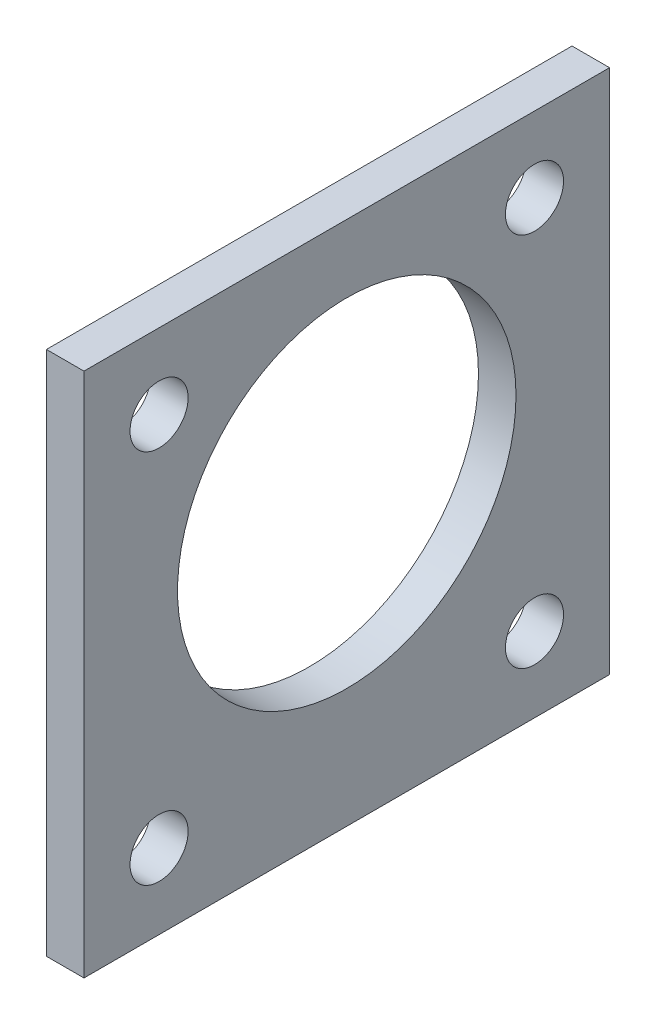
ISO-10303-21;
HEADER;
FILE_DESCRIPTION(('STEP AP214'),'2;1');
FILE_NAME('part.step','',(''),(''),'','','');
FILE_SCHEMA(('AUTOMOTIVE_DESIGN { 1 0 10303 214 1 1 1 1 }'));
ENDSEC;
DATA;
#1=APPLICATION_CONTEXT('core data for automotive mechanical design processes');
#2=APPLICATION_PROTOCOL_DEFINITION('international standard','automotive_design',2000,#1);
#3=PRODUCT_CONTEXT('',#1,'mechanical');
#4=PRODUCT('Part','Part','',(#3));
#5=PRODUCT_RELATED_PRODUCT_CATEGORY('part','',(#4));
#6=PRODUCT_DEFINITION_FORMATION('','',#4);
#7=PRODUCT_DEFINITION_CONTEXT('part definition',#1,'design');
#8=PRODUCT_DEFINITION('design','',#6,#7);
#9=PRODUCT_DEFINITION_SHAPE('','',#8);
#10=(LENGTH_UNIT() NAMED_UNIT(*) SI_UNIT(.MILLI.,.METRE.));
#11=(NAMED_UNIT(*) PLANE_ANGLE_UNIT() SI_UNIT($,.RADIAN.));
#12=(NAMED_UNIT(*) SI_UNIT($,.STERADIAN.) SOLID_ANGLE_UNIT());
#13=UNCERTAINTY_MEASURE_WITH_UNIT(LENGTH_MEASURE(1.E-05),#10,'distance_accuracy_value','');
#14=(GEOMETRIC_REPRESENTATION_CONTEXT(3) GLOBAL_UNCERTAINTY_ASSIGNED_CONTEXT((#13)) GLOBAL_UNIT_ASSIGNED_CONTEXT((#10,
#11,#12)) REPRESENTATION_CONTEXT('',''));
#15=CARTESIAN_POINT('',(0.,0.,0.));
#16=DIRECTION('',(0.,0.,1.));
#17=DIRECTION('',(1.,0.,0.));
#18=AXIS2_PLACEMENT_3D('',#15,#16,#17);
#19=CARTESIAN_POINT('',(3.175,-22.225,-22.225));
#20=DIRECTION('',(0.,0.,1.));
#21=DIRECTION('',(1.,0.,0.));
#22=AXIS2_PLACEMENT_3D('',#19,#20,#21);
#23=PLANE('',#22);
#24=DIRECTION('',(0.,1.,0.));
#25=VECTOR('',#24,1.);
#26=CARTESIAN_POINT('',(0.,-22.225,-22.225));
#27=LINE('',#26,#25);
#28=CARTESIAN_POINT('',(0.,-22.225,-22.225));
#29=VERTEX_POINT('',#28);
#30=CARTESIAN_POINT('',(0.,22.225,-22.225));
#31=VERTEX_POINT('',#30);
#32=EDGE_CURVE('E104',#29,#31,#27,.T.);
#33=ORIENTED_EDGE('',*,*,#32,.T.);
#34=DIRECTION('',(-1.,0.,0.));
#35=VECTOR('',#34,1.);
#36=CARTESIAN_POINT('',(3.175,22.225,-22.225));
#37=LINE('',#36,#35);
#38=CARTESIAN_POINT('',(3.175,22.225,-22.225));
#39=VERTEX_POINT('',#38);
#40=EDGE_CURVE('E11',#39,#31,#37,.T.);
#41=ORIENTED_EDGE('',*,*,#40,.F.);
#42=DIRECTION('',(0.,1.,0.));
#43=VECTOR('',#42,1.);
#44=CARTESIAN_POINT('',(3.175,-22.225,-22.225));
#45=LINE('',#44,#43);
#46=CARTESIAN_POINT('',(3.175,-22.225,-22.225));
#47=VERTEX_POINT('',#46);
#48=EDGE_CURVE('E92',#47,#39,#45,.T.);
#49=ORIENTED_EDGE('',*,*,#48,.F.);
#50=DIRECTION('',(-1.,0.,0.));
#51=VECTOR('',#50,1.);
#52=CARTESIAN_POINT('',(3.175,-22.225,-22.225));
#53=LINE('',#52,#51);
#54=EDGE_CURVE('E100',#47,#29,#53,.T.);
#55=ORIENTED_EDGE('',*,*,#54,.T.);
#56=EDGE_LOOP('',(#33,#41,#49,#55));
#57=FACE_BOUND('',#56,.T.);
#58=ADVANCED_FACE('F41',(#57),#23,.F.);
#59=CARTESIAN_POINT('',(3.175,22.225,22.225));
#60=DIRECTION('',(0.,-1.,0.));
#61=DIRECTION('',(0.,0.,-1.));
#62=AXIS2_PLACEMENT_3D('',#59,#60,#61);
#63=PLANE('',#62);
#64=DIRECTION('',(0.,0.,1.));
#65=VECTOR('',#64,1.);
#66=CARTESIAN_POINT('',(0.,22.225,22.225));
#67=LINE('',#66,#65);
#68=CARTESIAN_POINT('',(0.,22.225,22.225));
#69=VERTEX_POINT('',#68);
#70=EDGE_CURVE('E96',#31,#69,#67,.T.);
#71=ORIENTED_EDGE('',*,*,#70,.T.);
#72=DIRECTION('',(-1.,0.,0.));
#73=VECTOR('',#72,1.);
#74=CARTESIAN_POINT('',(3.175,22.225,22.225));
#75=LINE('',#74,#73);
#76=CARTESIAN_POINT('',(3.175,22.225,22.225));
#77=VERTEX_POINT('',#76);
#78=EDGE_CURVE('E49',#77,#69,#75,.T.);
#79=ORIENTED_EDGE('',*,*,#78,.F.);
#80=DIRECTION('',(0.,0.,1.));
#81=VECTOR('',#80,1.);
#82=CARTESIAN_POINT('',(3.175,22.225,22.225));
#83=LINE('',#82,#81);
#84=EDGE_CURVE('E87',#39,#77,#83,.T.);
#85=ORIENTED_EDGE('',*,*,#84,.F.);
#86=ORIENTED_EDGE('',*,*,#40,.T.);
#87=EDGE_LOOP('',(#71,#79,#85,#86));
#88=FACE_BOUND('',#87,.T.);
#89=ADVANCED_FACE('F95',(#88),#63,.F.);
#90=CARTESIAN_POINT('',(3.175,-22.225,22.225));
#91=DIRECTION('',(0.,0.,-1.));
#92=DIRECTION('',(-1.,0.,0.));
#93=AXIS2_PLACEMENT_3D('',#90,#91,#92);
#94=PLANE('',#93);
#95=DIRECTION('',(0.,-1.,0.));
#96=VECTOR('',#95,1.);
#97=CARTESIAN_POINT('',(0.,-22.225,22.225));
#98=LINE('',#97,#96);
#99=CARTESIAN_POINT('',(0.,-22.225,22.225));
#100=VERTEX_POINT('',#99);
#101=EDGE_CURVE('E74',#69,#100,#98,.T.);
#102=ORIENTED_EDGE('',*,*,#101,.T.);
#103=DIRECTION('',(-1.,0.,0.));
#104=VECTOR('',#103,1.);
#105=CARTESIAN_POINT('',(3.175,-22.225,22.225));
#106=LINE('',#105,#104);
#107=CARTESIAN_POINT('',(3.175,-22.225,22.225));
#108=VERTEX_POINT('',#107);
#109=EDGE_CURVE('E97',#108,#100,#106,.T.);
#110=ORIENTED_EDGE('',*,*,#109,.F.);
#111=DIRECTION('',(0.,-1.,0.));
#112=VECTOR('',#111,1.);
#113=CARTESIAN_POINT('',(3.175,-22.225,22.225));
#114=LINE('',#113,#112);
#115=EDGE_CURVE('E90',#77,#108,#114,.T.);
#116=ORIENTED_EDGE('',*,*,#115,.F.);
#117=ORIENTED_EDGE('',*,*,#78,.T.);
#118=EDGE_LOOP('',(#102,#110,#116,#117));
#119=FACE_BOUND('',#118,.T.);
#120=ADVANCED_FACE('F98',(#119),#94,.F.);
#121=CARTESIAN_POINT('',(3.175,-22.225,22.225));
#122=DIRECTION('',(0.,1.,0.));
#123=DIRECTION('',(0.,0.,1.));
#124=AXIS2_PLACEMENT_3D('',#121,#122,#123);
#125=PLANE('',#124);
#126=DIRECTION('',(0.,0.,-1.));
#127=VECTOR('',#126,1.);
#128=CARTESIAN_POINT('',(0.,-22.225,22.225));
#129=LINE('',#128,#127);
#130=EDGE_CURVE('E80',#100,#29,#129,.T.);
#131=ORIENTED_EDGE('',*,*,#130,.T.);
#132=ORIENTED_EDGE('',*,*,#54,.F.);
#133=DIRECTION('',(0.,0.,-1.));
#134=VECTOR('',#133,1.);
#135=CARTESIAN_POINT('',(3.175,-22.225,22.225));
#136=LINE('',#135,#134);
#137=EDGE_CURVE('E57',#108,#47,#136,.T.);
#138=ORIENTED_EDGE('',*,*,#137,.F.);
#139=ORIENTED_EDGE('',*,*,#109,.T.);
#140=EDGE_LOOP('',(#131,#132,#138,#139));
#141=FACE_BOUND('',#140,.T.);
#142=ADVANCED_FACE('F112',(#141),#125,.F.);
#143=CARTESIAN_POINT('',(3.175,0.,0.));
#144=DIRECTION('',(-1.,0.,0.));
#145=DIRECTION('',(0.,0.,1.));
#146=AXIS2_PLACEMENT_3D('',#143,#144,#145);
#147=PLANE('',#146);
#148=CARTESIAN_POINT('',(3.175,-15.875,15.875));
#149=DIRECTION('',(1.,0.,0.));
#150=DIRECTION('',(0.,0.,-1.));
#151=AXIS2_PLACEMENT_3D('',#148,#149,#150);
#152=CIRCLE('',#151,2.45745);
#153=CARTESIAN_POINT('',(3.175,-15.875,13.41755));
#154=VERTEX_POINT('',#153);
#155=EDGE_CURVE('E127',#154,#154,#152,.T.);
#156=ORIENTED_EDGE('',*,*,#155,.F.);
#157=EDGE_LOOP('',(#156));
#158=FACE_BOUND('',#157,.T.);
#159=CARTESIAN_POINT('',(3.175,-15.875,-15.875));
#160=DIRECTION('',(1.,0.,0.));
#161=DIRECTION('',(0.,0.,-1.));
#162=AXIS2_PLACEMENT_3D('',#159,#160,#161);
#163=CIRCLE('',#162,2.45745);
#164=CARTESIAN_POINT('',(3.175,-15.875,-18.33245));
#165=VERTEX_POINT('',#164);
#166=EDGE_CURVE('E133',#165,#165,#163,.T.);
#167=ORIENTED_EDGE('',*,*,#166,.F.);
#168=EDGE_LOOP('',(#167));
#169=FACE_BOUND('',#168,.T.);
#170=CARTESIAN_POINT('',(3.175,15.875,-15.875));
#171=DIRECTION('',(1.,0.,0.));
#172=DIRECTION('',(0.,0.,-1.));
#173=AXIS2_PLACEMENT_3D('',#170,#171,#172);
#174=CIRCLE('',#173,2.45745);
#175=CARTESIAN_POINT('',(3.175,15.875,-18.33245));
#176=VERTEX_POINT('',#175);
#177=EDGE_CURVE('E139',#176,#176,#174,.T.);
#178=ORIENTED_EDGE('',*,*,#177,.F.);
#179=EDGE_LOOP('',(#178));
#180=FACE_BOUND('',#179,.T.);
#181=CARTESIAN_POINT('',(3.175,15.875,15.875));
#182=DIRECTION('',(1.,0.,0.));
#183=DIRECTION('',(0.,0.,-1.));
#184=AXIS2_PLACEMENT_3D('',#181,#182,#183);
#185=CIRCLE('',#184,2.45745);
#186=CARTESIAN_POINT('',(3.175,15.875,13.41755));
#187=VERTEX_POINT('',#186);
#188=EDGE_CURVE('E121',#187,#187,#185,.T.);
#189=ORIENTED_EDGE('',*,*,#188,.F.);
#190=EDGE_LOOP('',(#189));
#191=FACE_BOUND('',#190,.T.);
#192=CARTESIAN_POINT('',(3.175,2.175,0.));
#193=DIRECTION('',(1.,0.,0.));
#194=DIRECTION('',(0.,0.,-1.));
#195=AXIS2_PLACEMENT_3D('',#192,#193,#194);
#196=CIRCLE('',#195,14.3129);
#197=CARTESIAN_POINT('',(3.175,2.175,-14.3129));
#198=VERTEX_POINT('',#197);
#199=EDGE_CURVE('E118',#198,#198,#196,.T.);
#200=ORIENTED_EDGE('',*,*,#199,.F.);
#201=EDGE_LOOP('',(#200));
#202=FACE_BOUND('',#201,.T.);
#203=ORIENTED_EDGE('',*,*,#48,.T.);
#204=ORIENTED_EDGE('',*,*,#84,.T.);
#205=ORIENTED_EDGE('',*,*,#115,.T.);
#206=ORIENTED_EDGE('',*,*,#137,.T.);
#207=EDGE_LOOP('',(#203,#204,#205,#206));
#208=FACE_BOUND('',#207,.T.);
#209=ADVANCED_FACE('F88',(#158,#169,#180,#191,#202,#208),#147,.F.);
#210=CARTESIAN_POINT('',(0.,0.,0.));
#211=DIRECTION('',(-1.,0.,0.));
#212=DIRECTION('',(0.,0.,1.));
#213=AXIS2_PLACEMENT_3D('',#210,#211,#212);
#214=PLANE('',#213);
#215=CARTESIAN_POINT('',(0.,-15.875,15.875));
#216=DIRECTION('',(1.,0.,0.));
#217=DIRECTION('',(0.,0.,-1.));
#218=AXIS2_PLACEMENT_3D('',#215,#216,#217);
#219=CIRCLE('',#218,2.45745);
#220=CARTESIAN_POINT('',(0.,-15.875,13.41755));
#221=VERTEX_POINT('',#220);
#222=EDGE_CURVE('E124',#221,#221,#219,.T.);
#223=ORIENTED_EDGE('',*,*,#222,.T.);
#224=EDGE_LOOP('',(#223));
#225=FACE_BOUND('',#224,.T.);
#226=CARTESIAN_POINT('',(0.,-15.875,-15.875));
#227=DIRECTION('',(1.,0.,0.));
#228=DIRECTION('',(0.,0.,-1.));
#229=AXIS2_PLACEMENT_3D('',#226,#227,#228);
#230=CIRCLE('',#229,2.45745);
#231=CARTESIAN_POINT('',(0.,-15.875,-18.33245));
#232=VERTEX_POINT('',#231);
#233=EDGE_CURVE('E130',#232,#232,#230,.T.);
#234=ORIENTED_EDGE('',*,*,#233,.T.);
#235=EDGE_LOOP('',(#234));
#236=FACE_BOUND('',#235,.T.);
#237=CARTESIAN_POINT('',(0.,15.875,-15.875));
#238=DIRECTION('',(1.,0.,0.));
#239=DIRECTION('',(0.,0.,-1.));
#240=AXIS2_PLACEMENT_3D('',#237,#238,#239);
#241=CIRCLE('',#240,2.45745);
#242=CARTESIAN_POINT('',(0.,15.875,-18.33245));
#243=VERTEX_POINT('',#242);
#244=EDGE_CURVE('E136',#243,#243,#241,.T.);
#245=ORIENTED_EDGE('',*,*,#244,.T.);
#246=EDGE_LOOP('',(#245));
#247=FACE_BOUND('',#246,.T.);
#248=CARTESIAN_POINT('',(0.,15.875,15.875));
#249=DIRECTION('',(1.,0.,0.));
#250=DIRECTION('',(0.,0.,-1.));
#251=AXIS2_PLACEMENT_3D('',#248,#249,#250);
#252=CIRCLE('',#251,2.45745);
#253=CARTESIAN_POINT('',(0.,15.875,13.41755));
#254=VERTEX_POINT('',#253);
#255=EDGE_CURVE('E142',#254,#254,#252,.T.);
#256=ORIENTED_EDGE('',*,*,#255,.T.);
#257=EDGE_LOOP('',(#256));
#258=FACE_BOUND('',#257,.T.);
#259=CARTESIAN_POINT('',(0.,2.175,0.));
#260=DIRECTION('',(1.,0.,0.));
#261=DIRECTION('',(0.,0.,-1.));
#262=AXIS2_PLACEMENT_3D('',#259,#260,#261);
#263=CIRCLE('',#262,14.3129);
#264=CARTESIAN_POINT('',(0.,2.175,-14.3129));
#265=VERTEX_POINT('',#264);
#266=EDGE_CURVE('E107',#265,#265,#263,.T.);
#267=ORIENTED_EDGE('',*,*,#266,.T.);
#268=EDGE_LOOP('',(#267));
#269=FACE_BOUND('',#268,.T.);
#270=ORIENTED_EDGE('',*,*,#32,.F.);
#271=ORIENTED_EDGE('',*,*,#130,.F.);
#272=ORIENTED_EDGE('',*,*,#101,.F.);
#273=ORIENTED_EDGE('',*,*,#70,.F.);
#274=EDGE_LOOP('',(#270,#271,#272,#273));
#275=FACE_BOUND('',#274,.T.);
#276=ADVANCED_FACE('F115',(#225,#236,#247,#258,#269,#275),#214,.T.);
#277=CARTESIAN_POINT('',(0.,2.175,0.));
#278=DIRECTION('',(1.,0.,0.));
#279=DIRECTION('',(0.,0.,-1.));
#280=AXIS2_PLACEMENT_3D('',#277,#278,#279);
#281=CYLINDRICAL_SURFACE('',#280,14.3129);
#282=ORIENTED_EDGE('',*,*,#266,.F.);
#283=EDGE_LOOP('',(#282));
#284=FACE_BOUND('',#283,.T.);
#285=ORIENTED_EDGE('',*,*,#199,.T.);
#286=EDGE_LOOP('',(#285));
#287=FACE_BOUND('',#286,.T.);
#288=ADVANCED_FACE('F156',(#284,#287),#281,.F.);
#289=CARTESIAN_POINT('',(0.,15.875,15.875));
#290=DIRECTION('',(1.,0.,0.));
#291=DIRECTION('',(0.,0.,-1.));
#292=AXIS2_PLACEMENT_3D('',#289,#290,#291);
#293=CYLINDRICAL_SURFACE('',#292,2.45745);
#294=ORIENTED_EDGE('',*,*,#255,.F.);
#295=EDGE_LOOP('',(#294));
#296=FACE_BOUND('',#295,.T.);
#297=ORIENTED_EDGE('',*,*,#188,.T.);
#298=EDGE_LOOP('',(#297));
#299=FACE_BOUND('',#298,.T.);
#300=ADVANCED_FACE('F148',(#296,#299),#293,.F.);
#301=CARTESIAN_POINT('',(0.,15.875,-15.875));
#302=DIRECTION('',(1.,0.,0.));
#303=DIRECTION('',(0.,0.,-1.));
#304=AXIS2_PLACEMENT_3D('',#301,#302,#303);
#305=CYLINDRICAL_SURFACE('',#304,2.45745);
#306=ORIENTED_EDGE('',*,*,#244,.F.);
#307=EDGE_LOOP('',(#306));
#308=FACE_BOUND('',#307,.T.);
#309=ORIENTED_EDGE('',*,*,#177,.T.);
#310=EDGE_LOOP('',(#309));
#311=FACE_BOUND('',#310,.T.);
#312=ADVANCED_FACE('F164',(#308,#311),#305,.F.);
#313=CARTESIAN_POINT('',(0.,-15.875,-15.875));
#314=DIRECTION('',(1.,0.,0.));
#315=DIRECTION('',(0.,0.,-1.));
#316=AXIS2_PLACEMENT_3D('',#313,#314,#315);
#317=CYLINDRICAL_SURFACE('',#316,2.45745);
#318=ORIENTED_EDGE('',*,*,#233,.F.);
#319=EDGE_LOOP('',(#318));
#320=FACE_BOUND('',#319,.T.);
#321=ORIENTED_EDGE('',*,*,#166,.T.);
#322=EDGE_LOOP('',(#321));
#323=FACE_BOUND('',#322,.T.);
#324=ADVANCED_FACE('F215',(#320,#323),#317,.F.);
#325=CARTESIAN_POINT('',(0.,-15.875,15.875));
#326=DIRECTION('',(1.,0.,0.));
#327=DIRECTION('',(0.,0.,-1.));
#328=AXIS2_PLACEMENT_3D('',#325,#326,#327);
#329=CYLINDRICAL_SURFACE('',#328,2.45745);
#330=ORIENTED_EDGE('',*,*,#222,.F.);
#331=EDGE_LOOP('',(#330));
#332=FACE_BOUND('',#331,.T.);
#333=ORIENTED_EDGE('',*,*,#155,.T.);
#334=EDGE_LOOP('',(#333));
#335=FACE_BOUND('',#334,.T.);
#336=ADVANCED_FACE('F225',(#332,#335),#329,.F.);
#337=CLOSED_SHELL('',(#58,#89,#120,#142,#209,#276,#288,#300,#312,#324,#336));
#338=MANIFOLD_SOLID_BREP('B2',#337);
#339=ADVANCED_BREP_SHAPE_REPRESENTATION('',(#18,#338),#14);
#340=SHAPE_DEFINITION_REPRESENTATION(#9,#339);
ENDSEC;
END-ISO-10303-21;
